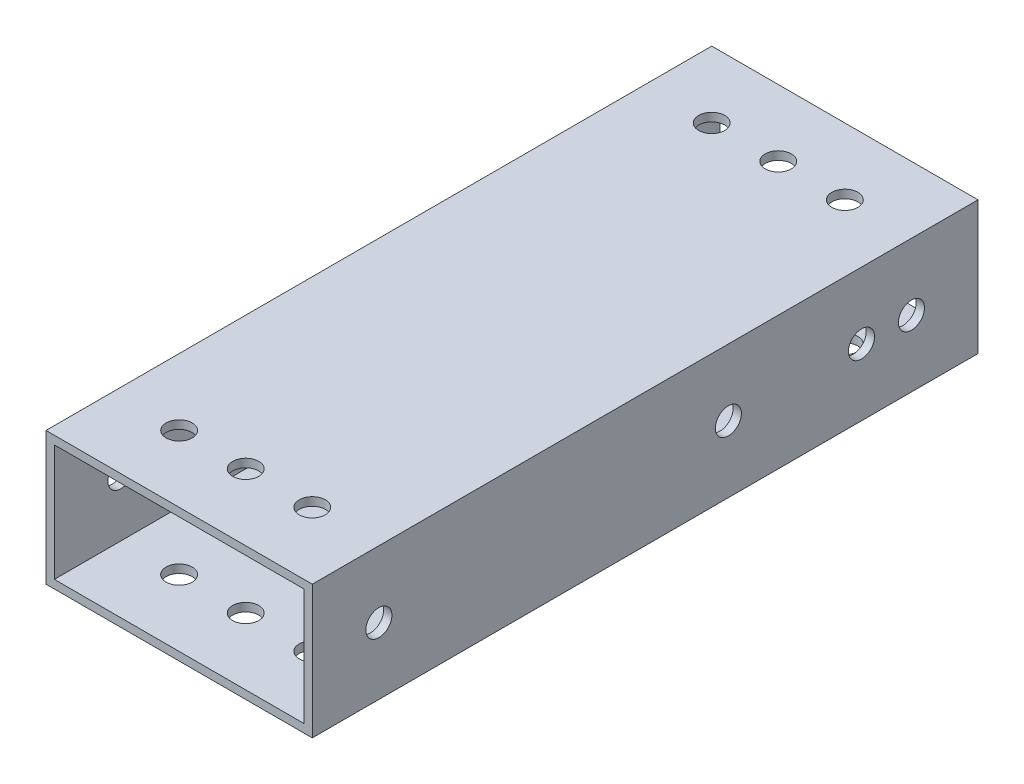
ISO-10303-21;
HEADER;
FILE_DESCRIPTION(('STEP AP214'),'2;1');
FILE_NAME('part.step','',(''),(''),'','','');
FILE_SCHEMA(('AUTOMOTIVE_DESIGN { 1 0 10303 214 1 1 1 1 }'));
ENDSEC;
DATA;
#1=APPLICATION_CONTEXT('core data for automotive mechanical design processes');
#2=APPLICATION_PROTOCOL_DEFINITION('international standard','automotive_design',2000,#1);
#3=PRODUCT_CONTEXT('',#1,'mechanical');
#4=PRODUCT('Part','Part','',(#3));
#5=PRODUCT_RELATED_PRODUCT_CATEGORY('part','',(#4));
#6=PRODUCT_DEFINITION_FORMATION('','',#4);
#7=PRODUCT_DEFINITION_CONTEXT('part definition',#1,'design');
#8=PRODUCT_DEFINITION('design','',#6,#7);
#9=PRODUCT_DEFINITION_SHAPE('','',#8);
#10=(LENGTH_UNIT() NAMED_UNIT(*) SI_UNIT(.MILLI.,.METRE.));
#11=(NAMED_UNIT(*) PLANE_ANGLE_UNIT() SI_UNIT($,.RADIAN.));
#12=(NAMED_UNIT(*) SI_UNIT($,.STERADIAN.) SOLID_ANGLE_UNIT());
#13=UNCERTAINTY_MEASURE_WITH_UNIT(LENGTH_MEASURE(1.E-05),#10,'distance_accuracy_value','');
#14=(GEOMETRIC_REPRESENTATION_CONTEXT(3) GLOBAL_UNCERTAINTY_ASSIGNED_CONTEXT((#13)) GLOBAL_UNIT_ASSIGNED_CONTEXT((#10,
#11,#12)) REPRESENTATION_CONTEXT('',''));
#15=CARTESIAN_POINT('',(0.,0.,0.));
#16=DIRECTION('',(0.,0.,1.));
#17=DIRECTION('',(1.,0.,0.));
#18=AXIS2_PLACEMENT_3D('',#15,#16,#17);
#19=CARTESIAN_POINT('',(25.4,-12.7,63.5));
#20=DIRECTION('',(-1.,0.,0.));
#21=DIRECTION('',(0.,0.,1.));
#22=AXIS2_PLACEMENT_3D('',#19,#20,#21);
#23=PLANE('',#22);
#24=CARTESIAN_POINT('',(25.4,0.,-41.275));
#25=DIRECTION('',(1.,0.,0.));
#26=DIRECTION('',(0.,0.,-1.));
#27=AXIS2_PLACEMENT_3D('',#24,#25,#26);
#28=CIRCLE('',#27,2.4892);
#29=CARTESIAN_POINT('',(25.4,0.,-43.7642));
#30=VERTEX_POINT('',#29);
#31=EDGE_CURVE('E254',#30,#30,#28,.T.);
#32=ORIENTED_EDGE('',*,*,#31,.F.);
#33=EDGE_LOOP('',(#32));
#34=FACE_BOUND('',#33,.T.);
#35=CARTESIAN_POINT('',(25.4,0.,-15.875));
#36=DIRECTION('',(1.,0.,0.));
#37=DIRECTION('',(0.,0.,-1.));
#38=AXIS2_PLACEMENT_3D('',#35,#36,#37);
#39=CIRCLE('',#38,2.4892);
#40=CARTESIAN_POINT('',(25.4,0.,-18.3642));
#41=VERTEX_POINT('',#40);
#42=EDGE_CURVE('E268',#41,#41,#39,.T.);
#43=ORIENTED_EDGE('',*,*,#42,.F.);
#44=EDGE_LOOP('',(#43));
#45=FACE_BOUND('',#44,.T.);
#46=CARTESIAN_POINT('',(25.4,0.,-50.8));
#47=DIRECTION('',(-1.,0.,0.));
#48=DIRECTION('',(0.,0.,1.));
#49=AXIS2_PLACEMENT_3D('',#46,#47,#48);
#50=CIRCLE('',#49,2.4892);
#51=CARTESIAN_POINT('',(25.4,0.,-48.3108));
#52=VERTEX_POINT('',#51);
#53=EDGE_CURVE('E276',#52,#52,#50,.T.);
#54=ORIENTED_EDGE('',*,*,#53,.T.);
#55=EDGE_LOOP('',(#54));
#56=FACE_BOUND('',#55,.T.);
#57=DIRECTION('',(0.,1.,0.));
#58=VECTOR('',#57,1.);
#59=CARTESIAN_POINT('',(25.4,-12.7,-63.5));
#60=LINE('',#59,#58);
#61=CARTESIAN_POINT('',(25.4,-12.7,-63.5));
#62=VERTEX_POINT('',#61);
#63=CARTESIAN_POINT('',(25.4,12.7,-63.5));
#64=VERTEX_POINT('',#63);
#65=EDGE_CURVE('E129',#62,#64,#60,.T.);
#66=ORIENTED_EDGE('',*,*,#65,.T.);
#67=DIRECTION('',(0.,0.,-1.));
#68=VECTOR('',#67,1.);
#69=CARTESIAN_POINT('',(25.4,12.7,63.5));
#70=LINE('',#69,#68);
#71=CARTESIAN_POINT('',(25.4,12.7,63.5));
#72=VERTEX_POINT('',#71);
#73=EDGE_CURVE('E11',#72,#64,#70,.T.);
#74=ORIENTED_EDGE('',*,*,#73,.F.);
#75=DIRECTION('',(0.,1.,0.));
#76=VECTOR('',#75,1.);
#77=CARTESIAN_POINT('',(25.4,-12.7,63.5));
#78=LINE('',#77,#76);
#79=CARTESIAN_POINT('',(25.4,-12.7,63.5));
#80=VERTEX_POINT('',#79);
#81=EDGE_CURVE('E164',#80,#72,#78,.T.);
#82=ORIENTED_EDGE('',*,*,#81,.F.);
#83=DIRECTION('',(0.,0.,-1.));
#84=VECTOR('',#83,1.);
#85=CARTESIAN_POINT('',(25.4,-12.7,63.5));
#86=LINE('',#85,#84);
#87=EDGE_CURVE('E178',#80,#62,#86,.T.);
#88=ORIENTED_EDGE('',*,*,#87,.T.);
#89=EDGE_LOOP('',(#66,#74,#82,#88));
#90=FACE_BOUND('',#89,.T.);
#91=CARTESIAN_POINT('',(25.4,0.,50.8));
#92=DIRECTION('',(1.,0.,0.));
#93=DIRECTION('',(0.,0.,-1.));
#94=AXIS2_PLACEMENT_3D('',#91,#92,#93);
#95=CIRCLE('',#94,2.4892);
#96=CARTESIAN_POINT('',(25.4,0.,48.3108));
#97=VERTEX_POINT('',#96);
#98=EDGE_CURVE('E235',#97,#97,#95,.T.);
#99=ORIENTED_EDGE('',*,*,#98,.F.);
#100=EDGE_LOOP('',(#99));
#101=FACE_BOUND('',#100,.T.);
#102=ADVANCED_FACE('F43',(#34,#45,#56,#90,#101),#23,.F.);
#103=CARTESIAN_POINT('',(-25.4,-12.7,63.5));
#104=DIRECTION('',(1.,0.,0.));
#105=DIRECTION('',(0.,0.,-1.));
#106=AXIS2_PLACEMENT_3D('',#103,#104,#105);
#107=PLANE('',#106);
#108=CARTESIAN_POINT('',(-25.4,0.,-41.275));
#109=DIRECTION('',(1.,0.,0.));
#110=DIRECTION('',(0.,0.,-1.));
#111=AXIS2_PLACEMENT_3D('',#108,#109,#110);
#112=CIRCLE('',#111,2.4892);
#113=CARTESIAN_POINT('',(-25.4,0.,-43.7642));
#114=VERTEX_POINT('',#113);
#115=EDGE_CURVE('E244',#114,#114,#112,.T.);
#116=ORIENTED_EDGE('',*,*,#115,.T.);
#117=EDGE_LOOP('',(#116));
#118=FACE_BOUND('',#117,.T.);
#119=CARTESIAN_POINT('',(-25.4,0.,-15.875));
#120=DIRECTION('',(1.,0.,0.));
#121=DIRECTION('',(0.,0.,-1.));
#122=AXIS2_PLACEMENT_3D('',#119,#120,#121);
#123=CIRCLE('',#122,2.4892);
#124=CARTESIAN_POINT('',(-25.4,0.,-18.3642));
#125=VERTEX_POINT('',#124);
#126=EDGE_CURVE('E262',#125,#125,#123,.T.);
#127=ORIENTED_EDGE('',*,*,#126,.T.);
#128=EDGE_LOOP('',(#127));
#129=FACE_BOUND('',#128,.T.);
#130=CARTESIAN_POINT('',(-25.4,0.,-50.8));
#131=DIRECTION('',(-1.,0.,0.));
#132=DIRECTION('',(0.,0.,1.));
#133=AXIS2_PLACEMENT_3D('',#130,#131,#132);
#134=CIRCLE('',#133,2.4892);
#135=CARTESIAN_POINT('',(-25.4,0.,-48.3108));
#136=VERTEX_POINT('',#135);
#137=EDGE_CURVE('E284',#136,#136,#134,.T.);
#138=ORIENTED_EDGE('',*,*,#137,.F.);
#139=EDGE_LOOP('',(#138));
#140=FACE_BOUND('',#139,.T.);
#141=DIRECTION('',(0.,-1.,0.));
#142=VECTOR('',#141,1.);
#143=CARTESIAN_POINT('',(-25.4,-12.7,-63.5));
#144=LINE('',#143,#142);
#145=CARTESIAN_POINT('',(-25.4,12.7,-63.5));
#146=VERTEX_POINT('',#145);
#147=CARTESIAN_POINT('',(-25.4,-12.7,-63.5));
#148=VERTEX_POINT('',#147);
#149=EDGE_CURVE('E185',#146,#148,#144,.T.);
#150=ORIENTED_EDGE('',*,*,#149,.T.);
#151=DIRECTION('',(0.,0.,-1.));
#152=VECTOR('',#151,1.);
#153=CARTESIAN_POINT('',(-25.4,-12.7,63.5));
#154=LINE('',#153,#152);
#155=CARTESIAN_POINT('',(-25.4,-12.7,63.5));
#156=VERTEX_POINT('',#155);
#157=EDGE_CURVE('E193',#156,#148,#154,.T.);
#158=ORIENTED_EDGE('',*,*,#157,.F.);
#159=DIRECTION('',(0.,-1.,0.));
#160=VECTOR('',#159,1.);
#161=CARTESIAN_POINT('',(-25.4,-12.7,63.5));
#162=LINE('',#161,#160);
#163=CARTESIAN_POINT('',(-25.4,12.7,63.5));
#164=VERTEX_POINT('',#163);
#165=EDGE_CURVE('E172',#164,#156,#162,.T.);
#166=ORIENTED_EDGE('',*,*,#165,.F.);
#167=DIRECTION('',(0.,0.,-1.));
#168=VECTOR('',#167,1.);
#169=CARTESIAN_POINT('',(-25.4,12.7,63.5));
#170=LINE('',#169,#168);
#171=EDGE_CURVE('E52',#164,#146,#170,.T.);
#172=ORIENTED_EDGE('',*,*,#171,.T.);
#173=EDGE_LOOP('',(#150,#158,#166,#172));
#174=FACE_BOUND('',#173,.T.);
#175=CARTESIAN_POINT('',(-25.4,0.,50.8));
#176=DIRECTION('',(1.,0.,0.));
#177=DIRECTION('',(0.,0.,-1.));
#178=AXIS2_PLACEMENT_3D('',#175,#176,#177);
#179=CIRCLE('',#178,2.4892);
#180=CARTESIAN_POINT('',(-25.4,0.,48.3108));
#181=VERTEX_POINT('',#180);
#182=EDGE_CURVE('E280',#181,#181,#179,.T.);
#183=ORIENTED_EDGE('',*,*,#182,.T.);
#184=EDGE_LOOP('',(#183));
#185=FACE_BOUND('',#184,.T.);
#186=ADVANCED_FACE('F414',(#118,#129,#140,#174,#185),#107,.F.);
#187=CARTESIAN_POINT('',(-23.8125,-11.1125,63.5));
#188=DIRECTION('',(1.,0.,0.));
#189=DIRECTION('',(0.,0.,-1.));
#190=AXIS2_PLACEMENT_3D('',#187,#188,#189);
#191=PLANE('',#190);
#192=CARTESIAN_POINT('',(-23.8125,0.,-41.275));
#193=DIRECTION('',(1.,0.,0.));
#194=DIRECTION('',(0.,0.,-1.));
#195=AXIS2_PLACEMENT_3D('',#192,#193,#194);
#196=CIRCLE('',#195,2.4892);
#197=CARTESIAN_POINT('',(-23.8125,0.,-43.7642));
#198=VERTEX_POINT('',#197);
#199=EDGE_CURVE('E272',#198,#198,#196,.T.);
#200=ORIENTED_EDGE('',*,*,#199,.F.);
#201=EDGE_LOOP('',(#200));
#202=FACE_BOUND('',#201,.T.);
#203=CARTESIAN_POINT('',(-23.8125,0.,-15.875));
#204=DIRECTION('',(1.,0.,0.));
#205=DIRECTION('',(0.,0.,-1.));
#206=AXIS2_PLACEMENT_3D('',#203,#204,#205);
#207=CIRCLE('',#206,2.4892);
#208=CARTESIAN_POINT('',(-23.8125,0.,-18.3642));
#209=VERTEX_POINT('',#208);
#210=EDGE_CURVE('E243',#209,#209,#207,.T.);
#211=ORIENTED_EDGE('',*,*,#210,.F.);
#212=EDGE_LOOP('',(#211));
#213=FACE_BOUND('',#212,.T.);
#214=DIRECTION('',(0.,-1.,0.));
#215=VECTOR('',#214,1.);
#216=CARTESIAN_POINT('',(-23.8125,-11.1125,-63.5));
#217=LINE('',#216,#215);
#218=CARTESIAN_POINT('',(-23.8125,11.1125,-63.5));
#219=VERTEX_POINT('',#218);
#220=CARTESIAN_POINT('',(-23.8125,-11.1125,-63.5));
#221=VERTEX_POINT('',#220);
#222=EDGE_CURVE('E68',#219,#221,#217,.T.);
#223=ORIENTED_EDGE('',*,*,#222,.F.);
#224=DIRECTION('',(0.,0.,-1.));
#225=VECTOR('',#224,1.);
#226=CARTESIAN_POINT('',(-23.8125,11.1125,63.5));
#227=LINE('',#226,#225);
#228=CARTESIAN_POINT('',(-23.8125,11.1125,63.5));
#229=VERTEX_POINT('',#228);
#230=EDGE_CURVE('E115',#229,#219,#227,.T.);
#231=ORIENTED_EDGE('',*,*,#230,.F.);
#232=DIRECTION('',(0.,-1.,0.));
#233=VECTOR('',#232,1.);
#234=CARTESIAN_POINT('',(-23.8125,-11.1125,63.5));
#235=LINE('',#234,#233);
#236=CARTESIAN_POINT('',(-23.8125,-11.1125,63.5));
#237=VERTEX_POINT('',#236);
#238=EDGE_CURVE('E110',#229,#237,#235,.T.);
#239=ORIENTED_EDGE('',*,*,#238,.T.);
#240=DIRECTION('',(0.,0.,-1.));
#241=VECTOR('',#240,1.);
#242=CARTESIAN_POINT('',(-23.8125,-11.1125,63.5));
#243=LINE('',#242,#241);
#244=EDGE_CURVE('E114',#237,#221,#243,.T.);
#245=ORIENTED_EDGE('',*,*,#244,.T.);
#246=EDGE_LOOP('',(#223,#231,#239,#245));
#247=FACE_BOUND('',#246,.T.);
#248=CARTESIAN_POINT('',(-23.8125,0.,-50.8));
#249=DIRECTION('',(1.,0.,0.));
#250=DIRECTION('',(0.,0.,-1.));
#251=AXIS2_PLACEMENT_3D('',#248,#249,#250);
#252=CIRCLE('',#251,2.4892);
#253=CARTESIAN_POINT('',(-23.8125,0.,-53.2892));
#254=VERTEX_POINT('',#253);
#255=EDGE_CURVE('E234',#254,#254,#252,.T.);
#256=ORIENTED_EDGE('',*,*,#255,.F.);
#257=EDGE_LOOP('',(#256));
#258=FACE_BOUND('',#257,.T.);
#259=CARTESIAN_POINT('',(-23.8125,0.,50.8));
#260=DIRECTION('',(1.,0.,0.));
#261=DIRECTION('',(0.,0.,-1.));
#262=AXIS2_PLACEMENT_3D('',#259,#260,#261);
#263=CIRCLE('',#262,2.4892);
#264=CARTESIAN_POINT('',(-23.8125,0.,48.3108));
#265=VERTEX_POINT('',#264);
#266=EDGE_CURVE('E239',#265,#265,#263,.F.);
#267=ORIENTED_EDGE('',*,*,#266,.T.);
#268=EDGE_LOOP('',(#267));
#269=FACE_BOUND('',#268,.T.);
#270=ADVANCED_FACE('F112',(#202,#213,#247,#258,#269),#191,.T.);
#271=CARTESIAN_POINT('',(23.8125,-11.1125,63.5));
#272=DIRECTION('',(-1.,0.,0.));
#273=DIRECTION('',(0.,0.,1.));
#274=AXIS2_PLACEMENT_3D('',#271,#272,#273);
#275=PLANE('',#274);
#276=CARTESIAN_POINT('',(23.8125,0.,-41.275));
#277=DIRECTION('',(-1.,0.,0.));
#278=DIRECTION('',(0.,0.,1.));
#279=AXIS2_PLACEMENT_3D('',#276,#277,#278);
#280=CIRCLE('',#279,2.4892);
#281=CARTESIAN_POINT('',(23.8125,0.,-38.7858));
#282=VERTEX_POINT('',#281);
#283=EDGE_CURVE('E46',#282,#282,#280,.T.);
#284=ORIENTED_EDGE('',*,*,#283,.F.);
#285=EDGE_LOOP('',(#284));
#286=FACE_BOUND('',#285,.T.);
#287=CARTESIAN_POINT('',(23.8125,0.,-15.875));
#288=DIRECTION('',(-1.,0.,0.));
#289=DIRECTION('',(0.,0.,1.));
#290=AXIS2_PLACEMENT_3D('',#287,#288,#289);
#291=CIRCLE('',#290,2.4892);
#292=CARTESIAN_POINT('',(23.8125,0.,-13.3858));
#293=VERTEX_POINT('',#292);
#294=EDGE_CURVE('E240',#293,#293,#291,.T.);
#295=ORIENTED_EDGE('',*,*,#294,.F.);
#296=EDGE_LOOP('',(#295));
#297=FACE_BOUND('',#296,.T.);
#298=DIRECTION('',(0.,1.,0.));
#299=VECTOR('',#298,1.);
#300=CARTESIAN_POINT('',(23.8125,-11.1125,-63.5));
#301=LINE('',#300,#299);
#302=CARTESIAN_POINT('',(23.8125,-11.1125,-63.5));
#303=VERTEX_POINT('',#302);
#304=CARTESIAN_POINT('',(23.8125,11.1125,-63.5));
#305=VERTEX_POINT('',#304);
#306=EDGE_CURVE('E151',#303,#305,#301,.T.);
#307=ORIENTED_EDGE('',*,*,#306,.F.);
#308=DIRECTION('',(0.,0.,-1.));
#309=VECTOR('',#308,1.);
#310=CARTESIAN_POINT('',(23.8125,-11.1125,63.5));
#311=LINE('',#310,#309);
#312=CARTESIAN_POINT('',(23.8125,-11.1125,63.5));
#313=VERTEX_POINT('',#312);
#314=EDGE_CURVE('E130',#313,#303,#311,.T.);
#315=ORIENTED_EDGE('',*,*,#314,.F.);
#316=DIRECTION('',(0.,1.,0.));
#317=VECTOR('',#316,1.);
#318=CARTESIAN_POINT('',(23.8125,-11.1125,63.5));
#319=LINE('',#318,#317);
#320=CARTESIAN_POINT('',(23.8125,11.1125,63.5));
#321=VERTEX_POINT('',#320);
#322=EDGE_CURVE('E134',#313,#321,#319,.T.);
#323=ORIENTED_EDGE('',*,*,#322,.T.);
#324=DIRECTION('',(0.,0.,-1.));
#325=VECTOR('',#324,1.);
#326=CARTESIAN_POINT('',(23.8125,11.1125,63.5));
#327=LINE('',#326,#325);
#328=EDGE_CURVE('E60',#321,#305,#327,.T.);
#329=ORIENTED_EDGE('',*,*,#328,.T.);
#330=EDGE_LOOP('',(#307,#315,#323,#329));
#331=FACE_BOUND('',#330,.T.);
#332=CARTESIAN_POINT('',(23.8125,0.,-50.8));
#333=DIRECTION('',(-1.,0.,0.));
#334=DIRECTION('',(0.,0.,1.));
#335=AXIS2_PLACEMENT_3D('',#332,#333,#334);
#336=CIRCLE('',#335,2.4892);
#337=CARTESIAN_POINT('',(23.8125,0.,-48.3108));
#338=VERTEX_POINT('',#337);
#339=EDGE_CURVE('E230',#338,#338,#336,.T.);
#340=ORIENTED_EDGE('',*,*,#339,.F.);
#341=EDGE_LOOP('',(#340));
#342=FACE_BOUND('',#341,.T.);
#343=CARTESIAN_POINT('',(23.8125,0.,50.8));
#344=DIRECTION('',(-1.,0.,0.));
#345=DIRECTION('',(0.,0.,1.));
#346=AXIS2_PLACEMENT_3D('',#343,#344,#345);
#347=CIRCLE('',#346,2.4892);
#348=CARTESIAN_POINT('',(23.8125,0.,53.2892));
#349=VERTEX_POINT('',#348);
#350=EDGE_CURVE('E236',#349,#349,#347,.F.);
#351=ORIENTED_EDGE('',*,*,#350,.T.);
#352=EDGE_LOOP('',(#351));
#353=FACE_BOUND('',#352,.T.);
#354=ADVANCED_FACE('F483',(#286,#297,#331,#342,#353),#275,.T.);
#355=CARTESIAN_POINT('',(0.,0.,63.5));
#356=DIRECTION('',(0.,0.,-1.));
#357=DIRECTION('',(-1.,0.,0.));
#358=AXIS2_PLACEMENT_3D('',#355,#356,#357);
#359=PLANE('',#358);
#360=ORIENTED_EDGE('',*,*,#81,.T.);
#361=DIRECTION('',(-1.,0.,0.));
#362=VECTOR('',#361,1.);
#363=CARTESIAN_POINT('',(-25.4,12.7,63.5));
#364=LINE('',#363,#362);
#365=EDGE_CURVE('E168',#72,#164,#364,.T.);
#366=ORIENTED_EDGE('',*,*,#365,.T.);
#367=ORIENTED_EDGE('',*,*,#165,.T.);
#368=DIRECTION('',(1.,0.,0.));
#369=VECTOR('',#368,1.);
#370=CARTESIAN_POINT('',(-25.4,-12.7,63.5));
#371=LINE('',#370,#369);
#372=EDGE_CURVE('E175',#156,#80,#371,.T.);
#373=ORIENTED_EDGE('',*,*,#372,.T.);
#374=EDGE_LOOP('',(#360,#366,#367,#373));
#375=FACE_BOUND('',#374,.T.);
#376=ORIENTED_EDGE('',*,*,#238,.F.);
#377=DIRECTION('',(-1.,0.,0.));
#378=VECTOR('',#377,1.);
#379=CARTESIAN_POINT('',(-23.8125,11.1125,63.5));
#380=LINE('',#379,#378);
#381=EDGE_CURVE('E140',#321,#229,#380,.T.);
#382=ORIENTED_EDGE('',*,*,#381,.F.);
#383=ORIENTED_EDGE('',*,*,#322,.F.);
#384=DIRECTION('',(1.,0.,0.));
#385=VECTOR('',#384,1.);
#386=CARTESIAN_POINT('',(-23.8125,-11.1125,63.5));
#387=LINE('',#386,#385);
#388=EDGE_CURVE('E120',#237,#313,#387,.T.);
#389=ORIENTED_EDGE('',*,*,#388,.F.);
#390=EDGE_LOOP('',(#376,#382,#383,#389));
#391=FACE_BOUND('',#390,.T.);
#392=ADVANCED_FACE('F133',(#375,#391),#359,.F.);
#393=CARTESIAN_POINT('',(0.,0.,-63.5));
#394=DIRECTION('',(0.,0.,-1.));
#395=DIRECTION('',(-1.,0.,0.));
#396=AXIS2_PLACEMENT_3D('',#393,#394,#395);
#397=PLANE('',#396);
#398=ORIENTED_EDGE('',*,*,#65,.F.);
#399=DIRECTION('',(1.,0.,0.));
#400=VECTOR('',#399,1.);
#401=CARTESIAN_POINT('',(-25.4,-12.7,-63.5));
#402=LINE('',#401,#400);
#403=EDGE_CURVE('E169',#148,#62,#402,.T.);
#404=ORIENTED_EDGE('',*,*,#403,.F.);
#405=ORIENTED_EDGE('',*,*,#149,.F.);
#406=DIRECTION('',(-1.,0.,0.));
#407=VECTOR('',#406,1.);
#408=CARTESIAN_POINT('',(-25.4,12.7,-63.5));
#409=LINE('',#408,#407);
#410=EDGE_CURVE('E182',#64,#146,#409,.T.);
#411=ORIENTED_EDGE('',*,*,#410,.F.);
#412=EDGE_LOOP('',(#398,#404,#405,#411));
#413=FACE_BOUND('',#412,.T.);
#414=DIRECTION('',(-1.,0.,0.));
#415=VECTOR('',#414,1.);
#416=CARTESIAN_POINT('',(-23.8125,11.1125,-63.5));
#417=LINE('',#416,#415);
#418=EDGE_CURVE('E121',#305,#219,#417,.T.);
#419=ORIENTED_EDGE('',*,*,#418,.T.);
#420=ORIENTED_EDGE('',*,*,#222,.T.);
#421=DIRECTION('',(1.,0.,0.));
#422=VECTOR('',#421,1.);
#423=CARTESIAN_POINT('',(-23.8125,-11.1125,-63.5));
#424=LINE('',#423,#422);
#425=EDGE_CURVE('E127',#221,#303,#424,.T.);
#426=ORIENTED_EDGE('',*,*,#425,.T.);
#427=ORIENTED_EDGE('',*,*,#306,.T.);
#428=EDGE_LOOP('',(#419,#420,#426,#427));
#429=FACE_BOUND('',#428,.T.);
#430=ADVANCED_FACE('F407',(#413,#429),#397,.T.);
#431=CARTESIAN_POINT('',(-25.4,12.7,63.5));
#432=DIRECTION('',(0.,-1.,0.));
#433=DIRECTION('',(0.,0.,-1.));
#434=AXIS2_PLACEMENT_3D('',#431,#432,#433);
#435=PLANE('',#434);
#436=CARTESIAN_POINT('',(-12.7,12.7,50.8));
#437=DIRECTION('',(0.,1.,0.));
#438=DIRECTION('',(0.,0.,-1.));
#439=AXIS2_PLACEMENT_3D('',#436,#437,#438);
#440=CIRCLE('',#439,2.4892);
#441=CARTESIAN_POINT('',(-12.7,12.7,48.3108));
#442=VERTEX_POINT('',#441);
#443=EDGE_CURVE('E297',#442,#442,#440,.T.);
#444=ORIENTED_EDGE('',*,*,#443,.F.);
#445=EDGE_LOOP('',(#444));
#446=FACE_BOUND('',#445,.T.);
#447=CARTESIAN_POINT('',(0.,12.7,50.8));
#448=DIRECTION('',(0.,1.,0.));
#449=DIRECTION('',(0.,0.,-1.));
#450=AXIS2_PLACEMENT_3D('',#447,#448,#449);
#451=CIRCLE('',#450,2.4892);
#452=CARTESIAN_POINT('',(0.,12.7,48.3108));
#453=VERTEX_POINT('',#452);
#454=EDGE_CURVE('E327',#453,#453,#451,.T.);
#455=ORIENTED_EDGE('',*,*,#454,.F.);
#456=EDGE_LOOP('',(#455));
#457=FACE_BOUND('',#456,.T.);
#458=CARTESIAN_POINT('',(12.7,12.7,50.8));
#459=DIRECTION('',(0.,1.,0.));
#460=DIRECTION('',(0.,0.,-1.));
#461=AXIS2_PLACEMENT_3D('',#458,#459,#460);
#462=CIRCLE('',#461,2.4892);
#463=CARTESIAN_POINT('',(12.7,12.7,48.3108));
#464=VERTEX_POINT('',#463);
#465=EDGE_CURVE('E319',#464,#464,#462,.T.);
#466=ORIENTED_EDGE('',*,*,#465,.F.);
#467=EDGE_LOOP('',(#466));
#468=FACE_BOUND('',#467,.T.);
#469=CARTESIAN_POINT('',(12.7,12.7,-50.8));
#470=DIRECTION('',(0.,1.,0.));
#471=DIRECTION('',(0.,0.,1.));
#472=AXIS2_PLACEMENT_3D('',#469,#470,#471);
#473=CIRCLE('',#472,2.48919999999999);
#474=CARTESIAN_POINT('',(12.7,12.7,-48.3108));
#475=VERTEX_POINT('',#474);
#476=EDGE_CURVE('E311',#475,#475,#473,.T.);
#477=ORIENTED_EDGE('',*,*,#476,.F.);
#478=EDGE_LOOP('',(#477));
#479=FACE_BOUND('',#478,.T.);
#480=CARTESIAN_POINT('',(0.,12.7,-50.8));
#481=DIRECTION('',(0.,1.,0.));
#482=DIRECTION('',(0.,0.,1.));
#483=AXIS2_PLACEMENT_3D('',#480,#481,#482);
#484=CIRCLE('',#483,2.4892);
#485=CARTESIAN_POINT('',(0.,12.7,-48.3108));
#486=VERTEX_POINT('',#485);
#487=EDGE_CURVE('E303',#486,#486,#484,.T.);
#488=ORIENTED_EDGE('',*,*,#487,.F.);
#489=EDGE_LOOP('',(#488));
#490=FACE_BOUND('',#489,.T.);
#491=CARTESIAN_POINT('',(-12.7,12.7,-50.8));
#492=DIRECTION('',(0.,1.,0.));
#493=DIRECTION('',(0.,0.,1.));
#494=AXIS2_PLACEMENT_3D('',#491,#492,#493);
#495=CIRCLE('',#494,2.48919999999999);
#496=CARTESIAN_POINT('',(-12.7,12.7,-48.3108));
#497=VERTEX_POINT('',#496);
#498=EDGE_CURVE('E302',#497,#497,#495,.T.);
#499=ORIENTED_EDGE('',*,*,#498,.F.);
#500=EDGE_LOOP('',(#499));
#501=FACE_BOUND('',#500,.T.);
#502=ORIENTED_EDGE('',*,*,#410,.T.);
#503=ORIENTED_EDGE('',*,*,#171,.F.);
#504=ORIENTED_EDGE('',*,*,#365,.F.);
#505=ORIENTED_EDGE('',*,*,#73,.T.);
#506=EDGE_LOOP('',(#502,#503,#504,#505));
#507=FACE_BOUND('',#506,.T.);
#508=ADVANCED_FACE('F393',(#446,#457,#468,#479,#490,#501,#507),#435,.F.);
#509=CARTESIAN_POINT('',(-25.4,-12.7,63.5));
#510=DIRECTION('',(0.,1.,0.));
#511=DIRECTION('',(0.,0.,1.));
#512=AXIS2_PLACEMENT_3D('',#509,#510,#511);
#513=PLANE('',#512);
#514=CARTESIAN_POINT('',(-12.7,-12.7,50.8));
#515=DIRECTION('',(0.,1.,0.));
#516=DIRECTION('',(0.,0.,-1.));
#517=AXIS2_PLACEMENT_3D('',#514,#515,#516);
#518=CIRCLE('',#517,2.4892);
#519=CARTESIAN_POINT('',(-12.7,-12.7,48.3108));
#520=VERTEX_POINT('',#519);
#521=EDGE_CURVE('E331',#520,#520,#518,.T.);
#522=ORIENTED_EDGE('',*,*,#521,.T.);
#523=EDGE_LOOP('',(#522));
#524=FACE_BOUND('',#523,.T.);
#525=CARTESIAN_POINT('',(0.,-12.7,50.8));
#526=DIRECTION('',(0.,1.,0.));
#527=DIRECTION('',(0.,0.,-1.));
#528=AXIS2_PLACEMENT_3D('',#525,#526,#527);
#529=CIRCLE('',#528,2.4892);
#530=CARTESIAN_POINT('',(0.,-12.7,48.3108));
#531=VERTEX_POINT('',#530);
#532=EDGE_CURVE('E323',#531,#531,#529,.T.);
#533=ORIENTED_EDGE('',*,*,#532,.T.);
#534=EDGE_LOOP('',(#533));
#535=FACE_BOUND('',#534,.T.);
#536=CARTESIAN_POINT('',(12.7,-12.7,50.8));
#537=DIRECTION('',(0.,1.,0.));
#538=DIRECTION('',(0.,0.,-1.));
#539=AXIS2_PLACEMENT_3D('',#536,#537,#538);
#540=CIRCLE('',#539,2.4892);
#541=CARTESIAN_POINT('',(12.7,-12.7,48.3108));
#542=VERTEX_POINT('',#541);
#543=EDGE_CURVE('E315',#542,#542,#540,.T.);
#544=ORIENTED_EDGE('',*,*,#543,.T.);
#545=EDGE_LOOP('',(#544));
#546=FACE_BOUND('',#545,.T.);
#547=CARTESIAN_POINT('',(12.7,-12.7,-50.8));
#548=DIRECTION('',(0.,1.,0.));
#549=DIRECTION('',(0.,0.,1.));
#550=AXIS2_PLACEMENT_3D('',#547,#548,#549);
#551=CIRCLE('',#550,2.48919999999999);
#552=CARTESIAN_POINT('',(12.7,-12.7,-48.3108));
#553=VERTEX_POINT('',#552);
#554=EDGE_CURVE('E307',#553,#553,#551,.T.);
#555=ORIENTED_EDGE('',*,*,#554,.T.);
#556=EDGE_LOOP('',(#555));
#557=FACE_BOUND('',#556,.T.);
#558=CARTESIAN_POINT('',(0.,-12.7,-50.8));
#559=DIRECTION('',(0.,1.,0.));
#560=DIRECTION('',(0.,0.,1.));
#561=AXIS2_PLACEMENT_3D('',#558,#559,#560);
#562=CIRCLE('',#561,2.4892);
#563=CARTESIAN_POINT('',(0.,-12.7,-48.3108));
#564=VERTEX_POINT('',#563);
#565=EDGE_CURVE('E298',#564,#564,#562,.T.);
#566=ORIENTED_EDGE('',*,*,#565,.T.);
#567=EDGE_LOOP('',(#566));
#568=FACE_BOUND('',#567,.T.);
#569=CARTESIAN_POINT('',(-12.7,-12.7,-50.8));
#570=DIRECTION('',(0.,1.,0.));
#571=DIRECTION('',(0.,0.,1.));
#572=AXIS2_PLACEMENT_3D('',#569,#570,#571);
#573=CIRCLE('',#572,2.48919999999999);
#574=CARTESIAN_POINT('',(-12.7,-12.7,-48.3108));
#575=VERTEX_POINT('',#574);
#576=EDGE_CURVE('E205',#575,#575,#573,.T.);
#577=ORIENTED_EDGE('',*,*,#576,.T.);
#578=EDGE_LOOP('',(#577));
#579=FACE_BOUND('',#578,.T.);
#580=ORIENTED_EDGE('',*,*,#403,.T.);
#581=ORIENTED_EDGE('',*,*,#87,.F.);
#582=ORIENTED_EDGE('',*,*,#372,.F.);
#583=ORIENTED_EDGE('',*,*,#157,.T.);
#584=EDGE_LOOP('',(#580,#581,#582,#583));
#585=FACE_BOUND('',#584,.T.);
#586=ADVANCED_FACE('F370',(#524,#535,#546,#557,#568,#579,#585),#513,.F.);
#587=CARTESIAN_POINT('',(-23.8125,-11.1125,63.5));
#588=DIRECTION('',(0.,1.,0.));
#589=DIRECTION('',(0.,0.,1.));
#590=AXIS2_PLACEMENT_3D('',#587,#588,#589);
#591=PLANE('',#590);
#592=CARTESIAN_POINT('',(-12.7,-11.1125,50.8));
#593=DIRECTION('',(0.,1.,0.));
#594=DIRECTION('',(0.,0.,1.));
#595=AXIS2_PLACEMENT_3D('',#592,#593,#594);
#596=CIRCLE('',#595,2.4892);
#597=CARTESIAN_POINT('',(-12.7,-11.1125,53.2892));
#598=VERTEX_POINT('',#597);
#599=EDGE_CURVE('E148',#598,#598,#596,.T.);
#600=ORIENTED_EDGE('',*,*,#599,.F.);
#601=EDGE_LOOP('',(#600));
#602=FACE_BOUND('',#601,.T.);
#603=CARTESIAN_POINT('',(0.,-11.1125,50.8));
#604=DIRECTION('',(0.,1.,0.));
#605=DIRECTION('',(0.,0.,1.));
#606=AXIS2_PLACEMENT_3D('',#603,#604,#605);
#607=CIRCLE('',#606,2.4892);
#608=CARTESIAN_POINT('',(0.,-11.1125,53.2892));
#609=VERTEX_POINT('',#608);
#610=EDGE_CURVE('E225',#609,#609,#607,.T.);
#611=ORIENTED_EDGE('',*,*,#610,.F.);
#612=EDGE_LOOP('',(#611));
#613=FACE_BOUND('',#612,.T.);
#614=CARTESIAN_POINT('',(12.7,-11.1125,50.8));
#615=DIRECTION('',(0.,1.,0.));
#616=DIRECTION('',(0.,0.,1.));
#617=AXIS2_PLACEMENT_3D('',#614,#615,#616);
#618=CIRCLE('',#617,2.4892);
#619=CARTESIAN_POINT('',(12.7,-11.1125,53.2892));
#620=VERTEX_POINT('',#619);
#621=EDGE_CURVE('E220',#620,#620,#618,.T.);
#622=ORIENTED_EDGE('',*,*,#621,.F.);
#623=EDGE_LOOP('',(#622));
#624=FACE_BOUND('',#623,.T.);
#625=CARTESIAN_POINT('',(12.7,-11.1125,-50.8));
#626=DIRECTION('',(0.,1.,0.));
#627=DIRECTION('',(0.,0.,1.));
#628=AXIS2_PLACEMENT_3D('',#625,#626,#627);
#629=CIRCLE('',#628,2.48919999999999);
#630=CARTESIAN_POINT('',(12.7,-11.1125,-48.3108));
#631=VERTEX_POINT('',#630);
#632=EDGE_CURVE('E215',#631,#631,#629,.T.);
#633=ORIENTED_EDGE('',*,*,#632,.F.);
#634=EDGE_LOOP('',(#633));
#635=FACE_BOUND('',#634,.T.);
#636=CARTESIAN_POINT('',(0.,-11.1125,-50.8));
#637=DIRECTION('',(0.,1.,0.));
#638=DIRECTION('',(0.,0.,1.));
#639=AXIS2_PLACEMENT_3D('',#636,#637,#638);
#640=CIRCLE('',#639,2.4892);
#641=CARTESIAN_POINT('',(0.,-11.1125,-48.3108));
#642=VERTEX_POINT('',#641);
#643=EDGE_CURVE('E210',#642,#642,#640,.T.);
#644=ORIENTED_EDGE('',*,*,#643,.F.);
#645=EDGE_LOOP('',(#644));
#646=FACE_BOUND('',#645,.T.);
#647=CARTESIAN_POINT('',(-12.7,-11.1125,-50.8));
#648=DIRECTION('',(0.,1.,0.));
#649=DIRECTION('',(0.,0.,1.));
#650=AXIS2_PLACEMENT_3D('',#647,#648,#649);
#651=CIRCLE('',#650,2.48919999999999);
#652=CARTESIAN_POINT('',(-12.7,-11.1125,-48.3108));
#653=VERTEX_POINT('',#652);
#654=EDGE_CURVE('E204',#653,#653,#651,.T.);
#655=ORIENTED_EDGE('',*,*,#654,.F.);
#656=EDGE_LOOP('',(#655));
#657=FACE_BOUND('',#656,.T.);
#658=ORIENTED_EDGE('',*,*,#425,.F.);
#659=ORIENTED_EDGE('',*,*,#244,.F.);
#660=ORIENTED_EDGE('',*,*,#388,.T.);
#661=ORIENTED_EDGE('',*,*,#314,.T.);
#662=EDGE_LOOP('',(#658,#659,#660,#661));
#663=FACE_BOUND('',#662,.T.);
#664=ADVANCED_FACE('F124',(#602,#613,#624,#635,#646,#657,#663),#591,.T.);
#665=CARTESIAN_POINT('',(-23.8125,11.1125,63.5));
#666=DIRECTION('',(0.,-1.,0.));
#667=DIRECTION('',(1.,0.,0.));
#668=AXIS2_PLACEMENT_3D('',#665,#666,#667);
#669=PLANE('',#668);
#670=CARTESIAN_POINT('',(-12.7,11.1125,50.8));
#671=DIRECTION('',(0.,-1.,0.));
#672=DIRECTION('',(1.,0.,0.));
#673=AXIS2_PLACEMENT_3D('',#670,#671,#672);
#674=CIRCLE('',#673,2.4892);
#675=CARTESIAN_POINT('',(-10.2108,11.1125,50.8));
#676=VERTEX_POINT('',#675);
#677=EDGE_CURVE('E226',#676,#676,#674,.T.);
#678=ORIENTED_EDGE('',*,*,#677,.F.);
#679=EDGE_LOOP('',(#678));
#680=FACE_BOUND('',#679,.T.);
#681=CARTESIAN_POINT('',(0.,11.1125,50.8));
#682=DIRECTION('',(0.,-1.,0.));
#683=DIRECTION('',(1.,0.,0.));
#684=AXIS2_PLACEMENT_3D('',#681,#682,#683);
#685=CIRCLE('',#684,2.4892);
#686=CARTESIAN_POINT('',(2.48920000000001,11.1125,50.8));
#687=VERTEX_POINT('',#686);
#688=EDGE_CURVE('E221',#687,#687,#685,.T.);
#689=ORIENTED_EDGE('',*,*,#688,.F.);
#690=EDGE_LOOP('',(#689));
#691=FACE_BOUND('',#690,.T.);
#692=CARTESIAN_POINT('',(12.7,11.1125,50.8));
#693=DIRECTION('',(0.,-1.,0.));
#694=DIRECTION('',(1.,0.,0.));
#695=AXIS2_PLACEMENT_3D('',#692,#693,#694);
#696=CIRCLE('',#695,2.4892);
#697=CARTESIAN_POINT('',(15.1892,11.1125,50.8));
#698=VERTEX_POINT('',#697);
#699=EDGE_CURVE('E216',#698,#698,#696,.T.);
#700=ORIENTED_EDGE('',*,*,#699,.F.);
#701=EDGE_LOOP('',(#700));
#702=FACE_BOUND('',#701,.T.);
#703=CARTESIAN_POINT('',(12.7,11.1125,-50.8));
#704=DIRECTION('',(0.,-1.,0.));
#705=DIRECTION('',(1.,0.,0.));
#706=AXIS2_PLACEMENT_3D('',#703,#704,#705);
#707=CIRCLE('',#706,2.48919999999999);
#708=CARTESIAN_POINT('',(15.1892,11.1125,-50.8));
#709=VERTEX_POINT('',#708);
#710=EDGE_CURVE('E211',#709,#709,#707,.T.);
#711=ORIENTED_EDGE('',*,*,#710,.F.);
#712=EDGE_LOOP('',(#711));
#713=FACE_BOUND('',#712,.T.);
#714=CARTESIAN_POINT('',(0.,11.1125,-50.8));
#715=DIRECTION('',(0.,-1.,0.));
#716=DIRECTION('',(1.,0.,0.));
#717=AXIS2_PLACEMENT_3D('',#714,#715,#716);
#718=CIRCLE('',#717,2.4892);
#719=CARTESIAN_POINT('',(2.4892,11.1125,-50.8));
#720=VERTEX_POINT('',#719);
#721=EDGE_CURVE('E206',#720,#720,#718,.T.);
#722=ORIENTED_EDGE('',*,*,#721,.F.);
#723=EDGE_LOOP('',(#722));
#724=FACE_BOUND('',#723,.T.);
#725=CARTESIAN_POINT('',(-12.7,11.1125,-50.8));
#726=DIRECTION('',(0.,-1.,0.));
#727=DIRECTION('',(1.,0.,0.));
#728=AXIS2_PLACEMENT_3D('',#725,#726,#727);
#729=CIRCLE('',#728,2.48919999999999);
#730=CARTESIAN_POINT('',(-10.2108,11.1125,-50.8));
#731=VERTEX_POINT('',#730);
#732=EDGE_CURVE('E200',#731,#731,#729,.T.);
#733=ORIENTED_EDGE('',*,*,#732,.F.);
#734=EDGE_LOOP('',(#733));
#735=FACE_BOUND('',#734,.T.);
#736=ORIENTED_EDGE('',*,*,#418,.F.);
#737=ORIENTED_EDGE('',*,*,#328,.F.);
#738=ORIENTED_EDGE('',*,*,#381,.T.);
#739=ORIENTED_EDGE('',*,*,#230,.T.);
#740=EDGE_LOOP('',(#736,#737,#738,#739));
#741=FACE_BOUND('',#740,.T.);
#742=ADVANCED_FACE('F369',(#680,#691,#702,#713,#724,#735,#741),#669,.T.);
#743=CARTESIAN_POINT('',(-12.7,-12.7,-50.8));
#744=DIRECTION('',(0.,1.,0.));
#745=DIRECTION('',(0.,0.,1.));
#746=AXIS2_PLACEMENT_3D('',#743,#744,#745);
#747=CYLINDRICAL_SURFACE('',#746,2.48919999999999);
#748=ORIENTED_EDGE('',*,*,#732,.T.);
#749=EDGE_LOOP('',(#748));
#750=FACE_BOUND('',#749,.T.);
#751=ORIENTED_EDGE('',*,*,#498,.T.);
#752=EDGE_LOOP('',(#751));
#753=FACE_BOUND('',#752,.T.);
#754=ADVANCED_FACE('F388',(#750,#753),#747,.F.);
#755=CARTESIAN_POINT('',(0.,-12.7,-50.8));
#756=DIRECTION('',(0.,1.,0.));
#757=DIRECTION('',(0.,0.,1.));
#758=AXIS2_PLACEMENT_3D('',#755,#756,#757);
#759=CYLINDRICAL_SURFACE('',#758,2.4892);
#760=ORIENTED_EDGE('',*,*,#721,.T.);
#761=EDGE_LOOP('',(#760));
#762=FACE_BOUND('',#761,.T.);
#763=ORIENTED_EDGE('',*,*,#487,.T.);
#764=EDGE_LOOP('',(#763));
#765=FACE_BOUND('',#764,.T.);
#766=ADVANCED_FACE('F458',(#762,#765),#759,.F.);
#767=CARTESIAN_POINT('',(12.7,-12.7,-50.8));
#768=DIRECTION('',(0.,1.,0.));
#769=DIRECTION('',(0.,0.,1.));
#770=AXIS2_PLACEMENT_3D('',#767,#768,#769);
#771=CYLINDRICAL_SURFACE('',#770,2.48919999999999);
#772=ORIENTED_EDGE('',*,*,#710,.T.);
#773=EDGE_LOOP('',(#772));
#774=FACE_BOUND('',#773,.T.);
#775=ORIENTED_EDGE('',*,*,#476,.T.);
#776=EDGE_LOOP('',(#775));
#777=FACE_BOUND('',#776,.T.);
#778=ADVANCED_FACE('F461',(#774,#777),#771,.F.);
#779=CARTESIAN_POINT('',(12.7,-12.7,50.8));
#780=DIRECTION('',(0.,1.,0.));
#781=DIRECTION('',(0.,0.,1.));
#782=AXIS2_PLACEMENT_3D('',#779,#780,#781);
#783=CYLINDRICAL_SURFACE('',#782,2.4892);
#784=ORIENTED_EDGE('',*,*,#699,.T.);
#785=EDGE_LOOP('',(#784));
#786=FACE_BOUND('',#785,.T.);
#787=ORIENTED_EDGE('',*,*,#465,.T.);
#788=EDGE_LOOP('',(#787));
#789=FACE_BOUND('',#788,.T.);
#790=ADVANCED_FACE('F465',(#786,#789),#783,.F.);
#791=CARTESIAN_POINT('',(0.,-12.7,50.8));
#792=DIRECTION('',(0.,1.,0.));
#793=DIRECTION('',(0.,0.,1.));
#794=AXIS2_PLACEMENT_3D('',#791,#792,#793);
#795=CYLINDRICAL_SURFACE('',#794,2.4892);
#796=ORIENTED_EDGE('',*,*,#688,.T.);
#797=EDGE_LOOP('',(#796));
#798=FACE_BOUND('',#797,.T.);
#799=ORIENTED_EDGE('',*,*,#454,.T.);
#800=EDGE_LOOP('',(#799));
#801=FACE_BOUND('',#800,.T.);
#802=ADVANCED_FACE('F470',(#798,#801),#795,.F.);
#803=CARTESIAN_POINT('',(-12.7,-12.7,50.8));
#804=DIRECTION('',(0.,1.,0.));
#805=DIRECTION('',(0.,0.,1.));
#806=AXIS2_PLACEMENT_3D('',#803,#804,#805);
#807=CYLINDRICAL_SURFACE('',#806,2.4892);
#808=ORIENTED_EDGE('',*,*,#677,.T.);
#809=EDGE_LOOP('',(#808));
#810=FACE_BOUND('',#809,.T.);
#811=ORIENTED_EDGE('',*,*,#443,.T.);
#812=EDGE_LOOP('',(#811));
#813=FACE_BOUND('',#812,.T.);
#814=ADVANCED_FACE('F386',(#810,#813),#807,.F.);
#815=ORIENTED_EDGE('',*,*,#654,.T.);
#816=EDGE_LOOP('',(#815));
#817=FACE_BOUND('',#816,.T.);
#818=ORIENTED_EDGE('',*,*,#576,.F.);
#819=EDGE_LOOP('',(#818));
#820=FACE_BOUND('',#819,.T.);
#821=ADVANCED_FACE('F382',(#817,#820),#747,.F.);
#822=ORIENTED_EDGE('',*,*,#643,.T.);
#823=EDGE_LOOP('',(#822));
#824=FACE_BOUND('',#823,.T.);
#825=ORIENTED_EDGE('',*,*,#565,.F.);
#826=EDGE_LOOP('',(#825));
#827=FACE_BOUND('',#826,.T.);
#828=ADVANCED_FACE('F385',(#824,#827),#759,.F.);
#829=ORIENTED_EDGE('',*,*,#632,.T.);
#830=EDGE_LOOP('',(#829));
#831=FACE_BOUND('',#830,.T.);
#832=ORIENTED_EDGE('',*,*,#554,.F.);
#833=EDGE_LOOP('',(#832));
#834=FACE_BOUND('',#833,.T.);
#835=ADVANCED_FACE('F467',(#831,#834),#771,.F.);
#836=ORIENTED_EDGE('',*,*,#621,.T.);
#837=EDGE_LOOP('',(#836));
#838=FACE_BOUND('',#837,.T.);
#839=ORIENTED_EDGE('',*,*,#543,.F.);
#840=EDGE_LOOP('',(#839));
#841=FACE_BOUND('',#840,.T.);
#842=ADVANCED_FACE('F472',(#838,#841),#783,.F.);
#843=ORIENTED_EDGE('',*,*,#610,.T.);
#844=EDGE_LOOP('',(#843));
#845=FACE_BOUND('',#844,.T.);
#846=ORIENTED_EDGE('',*,*,#532,.F.);
#847=EDGE_LOOP('',(#846));
#848=FACE_BOUND('',#847,.T.);
#849=ADVANCED_FACE('F455',(#845,#848),#795,.F.);
#850=ORIENTED_EDGE('',*,*,#599,.T.);
#851=EDGE_LOOP('',(#850));
#852=FACE_BOUND('',#851,.T.);
#853=ORIENTED_EDGE('',*,*,#521,.F.);
#854=EDGE_LOOP('',(#853));
#855=FACE_BOUND('',#854,.T.);
#856=ADVANCED_FACE('F364',(#852,#855),#807,.F.);
#857=CARTESIAN_POINT('',(25.4,0.,-50.8));
#858=DIRECTION('',(-1.,0.,0.));
#859=DIRECTION('',(0.,0.,1.));
#860=AXIS2_PLACEMENT_3D('',#857,#858,#859);
#861=CYLINDRICAL_SURFACE('',#860,2.4892);
#862=ORIENTED_EDGE('',*,*,#339,.T.);
#863=EDGE_LOOP('',(#862));
#864=FACE_BOUND('',#863,.T.);
#865=ORIENTED_EDGE('',*,*,#53,.F.);
#866=EDGE_LOOP('',(#865));
#867=FACE_BOUND('',#866,.T.);
#868=ADVANCED_FACE('F436',(#864,#867),#861,.F.);
#869=CARTESIAN_POINT('',(25.4,0.,50.8));
#870=DIRECTION('',(-1.,0.,0.));
#871=DIRECTION('',(0.,0.,1.));
#872=AXIS2_PLACEMENT_3D('',#869,#870,#871);
#873=CYLINDRICAL_SURFACE('',#872,2.4892);
#874=ORIENTED_EDGE('',*,*,#350,.F.);
#875=EDGE_LOOP('',(#874));
#876=FACE_BOUND('',#875,.T.);
#877=ORIENTED_EDGE('',*,*,#98,.T.);
#878=EDGE_LOOP('',(#877));
#879=FACE_BOUND('',#878,.T.);
#880=ADVANCED_FACE('F426',(#876,#879),#873,.F.);
#881=ORIENTED_EDGE('',*,*,#255,.T.);
#882=EDGE_LOOP('',(#881));
#883=FACE_BOUND('',#882,.T.);
#884=ORIENTED_EDGE('',*,*,#137,.T.);
#885=EDGE_LOOP('',(#884));
#886=FACE_BOUND('',#885,.T.);
#887=ADVANCED_FACE('F423',(#883,#886),#861,.F.);
#888=ORIENTED_EDGE('',*,*,#266,.F.);
#889=EDGE_LOOP('',(#888));
#890=FACE_BOUND('',#889,.T.);
#891=ORIENTED_EDGE('',*,*,#182,.F.);
#892=EDGE_LOOP('',(#891));
#893=FACE_BOUND('',#892,.T.);
#894=ADVANCED_FACE('F420',(#890,#893),#873,.F.);
#895=CARTESIAN_POINT('',(-25.4,0.,-15.875));
#896=DIRECTION('',(1.,0.,0.));
#897=DIRECTION('',(0.,0.,-1.));
#898=AXIS2_PLACEMENT_3D('',#895,#896,#897);
#899=CYLINDRICAL_SURFACE('',#898,2.4892);
#900=ORIENTED_EDGE('',*,*,#294,.T.);
#901=EDGE_LOOP('',(#900));
#902=FACE_BOUND('',#901,.T.);
#903=ORIENTED_EDGE('',*,*,#42,.T.);
#904=EDGE_LOOP('',(#903));
#905=FACE_BOUND('',#904,.T.);
#906=ADVANCED_FACE('F422',(#902,#905),#899,.F.);
#907=CARTESIAN_POINT('',(-25.4,0.,-41.275));
#908=DIRECTION('',(1.,0.,0.));
#909=DIRECTION('',(0.,0.,-1.));
#910=AXIS2_PLACEMENT_3D('',#907,#908,#909);
#911=CYLINDRICAL_SURFACE('',#910,2.4892);
#912=ORIENTED_EDGE('',*,*,#283,.T.);
#913=EDGE_LOOP('',(#912));
#914=FACE_BOUND('',#913,.T.);
#915=ORIENTED_EDGE('',*,*,#31,.T.);
#916=EDGE_LOOP('',(#915));
#917=FACE_BOUND('',#916,.T.);
#918=ADVANCED_FACE('F431',(#914,#917),#911,.F.);
#919=ORIENTED_EDGE('',*,*,#210,.T.);
#920=EDGE_LOOP('',(#919));
#921=FACE_BOUND('',#920,.T.);
#922=ORIENTED_EDGE('',*,*,#126,.F.);
#923=EDGE_LOOP('',(#922));
#924=FACE_BOUND('',#923,.T.);
#925=ADVANCED_FACE('F433',(#921,#924),#899,.F.);
#926=ORIENTED_EDGE('',*,*,#199,.T.);
#927=EDGE_LOOP('',(#926));
#928=FACE_BOUND('',#927,.T.);
#929=ORIENTED_EDGE('',*,*,#115,.F.);
#930=EDGE_LOOP('',(#929));
#931=FACE_BOUND('',#930,.T.);
#932=ADVANCED_FACE('F623',(#928,#931),#911,.F.);
#933=CLOSED_SHELL('',(#102,#186,#270,#354,#392,#430,#508,#586,#664,#742,#754,#766,#778,#790,
#802,#814,#821,#828,#835,#842,#849,#856,#868,#880,#887,#894,#906,#918,#925,#932));
#934=MANIFOLD_SOLID_BREP('B2',#933);
#935=ADVANCED_BREP_SHAPE_REPRESENTATION('',(#18,#934),#14);
#936=SHAPE_DEFINITION_REPRESENTATION(#9,#935);
ENDSEC;
END-ISO-10303-21;
